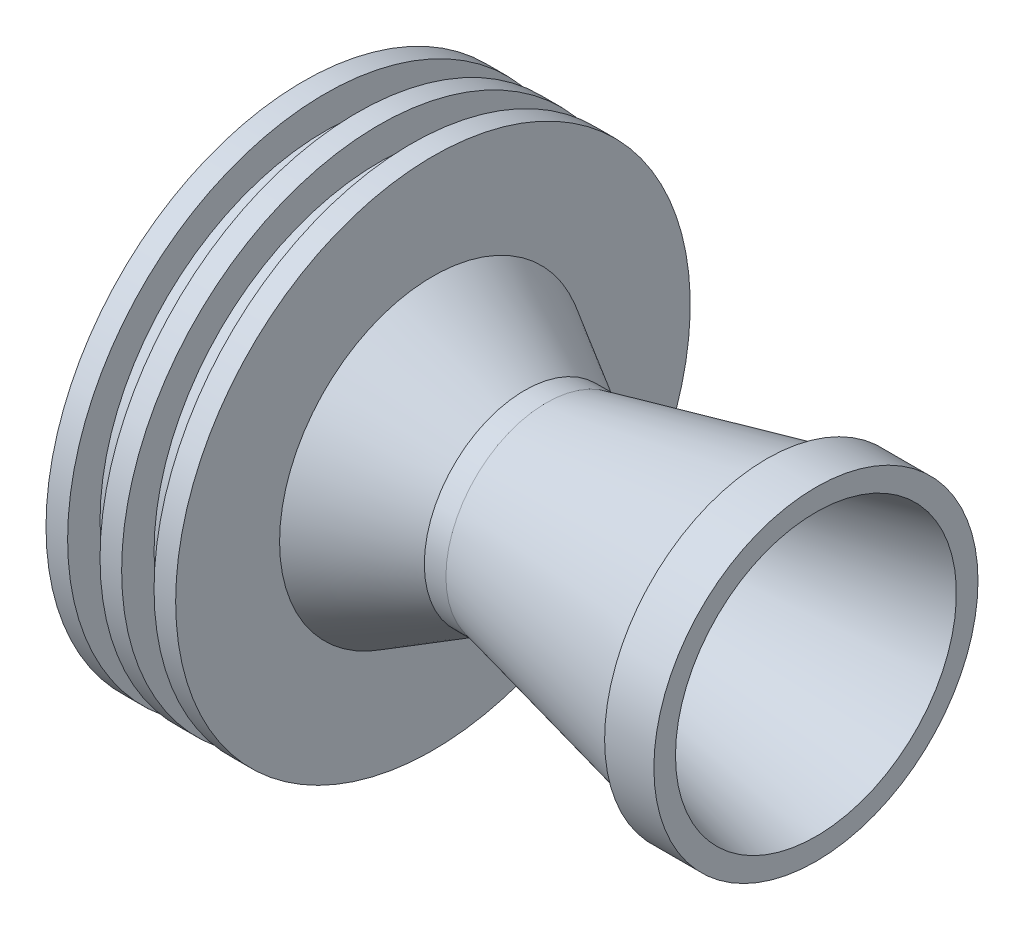
ISO-10303-21;
HEADER;
FILE_DESCRIPTION(('STEP AP214'),'2;1');
FILE_NAME('part.step','',(''),(''),'','','');
FILE_SCHEMA(('AUTOMOTIVE_DESIGN { 1 0 10303 214 1 1 1 1 }'));
ENDSEC;
DATA;
#1=APPLICATION_CONTEXT('core data for automotive mechanical design processes');
#2=APPLICATION_PROTOCOL_DEFINITION('international standard','automotive_design',2000,#1);
#3=PRODUCT_CONTEXT('',#1,'mechanical');
#4=PRODUCT('Part','Part','',(#3));
#5=PRODUCT_RELATED_PRODUCT_CATEGORY('part','',(#4));
#6=PRODUCT_DEFINITION_FORMATION('','',#4);
#7=PRODUCT_DEFINITION_CONTEXT('part definition',#1,'design');
#8=PRODUCT_DEFINITION('design','',#6,#7);
#9=PRODUCT_DEFINITION_SHAPE('','',#8);
#10=(LENGTH_UNIT() NAMED_UNIT(*) SI_UNIT(.MILLI.,.METRE.));
#11=(NAMED_UNIT(*) PLANE_ANGLE_UNIT() SI_UNIT($,.RADIAN.));
#12=(NAMED_UNIT(*) SI_UNIT($,.STERADIAN.) SOLID_ANGLE_UNIT());
#13=UNCERTAINTY_MEASURE_WITH_UNIT(LENGTH_MEASURE(1.E-05),#10,'distance_accuracy_value','');
#14=(GEOMETRIC_REPRESENTATION_CONTEXT(3) GLOBAL_UNCERTAINTY_ASSIGNED_CONTEXT((#13)) GLOBAL_UNIT_ASSIGNED_CONTEXT((#10,
#11,#12)) REPRESENTATION_CONTEXT('',''));
#15=CARTESIAN_POINT('',(0.,0.,0.));
#16=DIRECTION('',(0.,0.,1.));
#17=DIRECTION('',(1.,0.,0.));
#18=AXIS2_PLACEMENT_3D('',#15,#16,#17);
#19=CARTESIAN_POINT('',(0.,20.8125,0.));
#20=DIRECTION('',(1.,0.,0.));
#21=DIRECTION('',(0.,0.,-1.));
#22=AXIS2_PLACEMENT_3D('',#19,#20,#21);
#23=PLANE('',#22);
#24=CARTESIAN_POINT('',(0.,0.,0.));
#25=DIRECTION('',(-1.,0.,0.));
#26=DIRECTION('',(0.,0.,1.));
#27=AXIS2_PLACEMENT_3D('',#24,#25,#26);
#28=CIRCLE('',#27,18.8125);
#29=CARTESIAN_POINT('',(0.,0.,18.8125));
#30=VERTEX_POINT('',#29);
#31=EDGE_CURVE('E10',#30,#30,#28,.T.);
#32=ORIENTED_EDGE('',*,*,#31,.F.);
#33=EDGE_LOOP('',(#32));
#34=FACE_BOUND('',#33,.T.);
#35=CARTESIAN_POINT('',(0.,0.,0.));
#36=DIRECTION('',(-1.,0.,0.));
#37=DIRECTION('',(0.,0.,1.));
#38=AXIS2_PLACEMENT_3D('',#35,#36,#37);
#39=CIRCLE('',#38,23.8125);
#40=CARTESIAN_POINT('',(0.,0.,23.8125));
#41=VERTEX_POINT('',#40);
#42=EDGE_CURVE('E122',#41,#41,#39,.T.);
#43=ORIENTED_EDGE('',*,*,#42,.T.);
#44=EDGE_LOOP('',(#43));
#45=FACE_BOUND('',#44,.T.);
#46=ADVANCED_FACE('F37',(#34,#45),#23,.F.);
#47=CARTESIAN_POINT('',(0.,0.,0.));
#48=DIRECTION('',(-1.,0.,0.));
#49=DIRECTION('',(0.,0.,1.));
#50=AXIS2_PLACEMENT_3D('',#47,#48,#49);
#51=CONICAL_SURFACE('',#50,18.8125,0.523598775598287);
#52=CARTESIAN_POINT('',(20.459850164408,0.,0.));
#53=DIRECTION('',(-1.,0.,0.));
#54=DIRECTION('',(0.,0.,1.));
#55=AXIS2_PLACEMENT_3D('',#52,#53,#54);
#56=CIRCLE('',#55,6.99999999999998);
#57=CARTESIAN_POINT('',(20.459850164408,0.,6.99999999999998));
#58=VERTEX_POINT('',#57);
#59=EDGE_CURVE('E44',#58,#58,#56,.T.);
#60=ORIENTED_EDGE('',*,*,#59,.F.);
#61=EDGE_LOOP('',(#60));
#62=FACE_BOUND('',#61,.T.);
#63=ORIENTED_EDGE('',*,*,#31,.T.);
#64=EDGE_LOOP('',(#63));
#65=FACE_BOUND('',#64,.T.);
#66=ADVANCED_FACE('F233',(#62,#65),#51,.F.);
#67=CARTESIAN_POINT('',(-1000.,0.,0.));
#68=DIRECTION('',(-1.,0.,0.));
#69=DIRECTION('',(0.,0.,1.));
#70=AXIS2_PLACEMENT_3D('',#67,#68,#69);
#71=CYLINDRICAL_SURFACE('',#70,6.99999999999998);
#72=CARTESIAN_POINT('',(21.4598501644079,0.,0.));
#73=DIRECTION('',(-1.,0.,0.));
#74=DIRECTION('',(0.,0.,1.));
#75=AXIS2_PLACEMENT_3D('',#72,#73,#74);
#76=CIRCLE('',#75,6.99999999999998);
#77=CARTESIAN_POINT('',(21.4598501644079,0.,6.99999999999998));
#78=VERTEX_POINT('',#77);
#79=EDGE_CURVE('E50',#78,#78,#76,.T.);
#80=ORIENTED_EDGE('',*,*,#79,.F.);
#81=EDGE_LOOP('',(#80));
#82=FACE_BOUND('',#81,.T.);
#83=ORIENTED_EDGE('',*,*,#59,.T.);
#84=EDGE_LOOP('',(#83));
#85=FACE_BOUND('',#84,.T.);
#86=ADVANCED_FACE('F228',(#82,#85),#71,.F.);
#87=CARTESIAN_POINT('',(21.4598501644079,0.,0.));
#88=DIRECTION('',(1.,0.,0.));
#89=DIRECTION('',(0.,0.,-1.));
#90=AXIS2_PLACEMENT_3D('',#87,#88,#89);
#91=CONICAL_SURFACE('',#90,6.99999999999998,0.226892802759263);
#92=CARTESIAN_POINT('',(47.4487054101129,0.,0.));
#93=DIRECTION('',(-1.,0.,0.));
#94=DIRECTION('',(0.,0.,1.));
#95=AXIS2_PLACEMENT_3D('',#92,#93,#94);
#96=CIRCLE('',#95,13.);
#97=CARTESIAN_POINT('',(47.4487054101129,0.,13.));
#98=VERTEX_POINT('',#97);
#99=EDGE_CURVE('E56',#98,#98,#96,.T.);
#100=ORIENTED_EDGE('',*,*,#99,.F.);
#101=EDGE_LOOP('',(#100));
#102=FACE_BOUND('',#101,.T.);
#103=ORIENTED_EDGE('',*,*,#79,.T.);
#104=EDGE_LOOP('',(#103));
#105=FACE_BOUND('',#104,.T.);
#106=ADVANCED_FACE('F222',(#102,#105),#91,.F.);
#107=CARTESIAN_POINT('',(47.4487054101129,15.,0.));
#108=DIRECTION('',(-1.,0.,0.));
#109=DIRECTION('',(0.,0.,1.));
#110=AXIS2_PLACEMENT_3D('',#107,#108,#109);
#111=PLANE('',#110);
#112=CARTESIAN_POINT('',(47.4487054101129,0.,0.));
#113=DIRECTION('',(-1.,0.,0.));
#114=DIRECTION('',(0.,0.,1.));
#115=AXIS2_PLACEMENT_3D('',#112,#113,#114);
#116=CIRCLE('',#115,15.);
#117=CARTESIAN_POINT('',(47.4487054101129,0.,15.));
#118=VERTEX_POINT('',#117);
#119=EDGE_CURVE('E62',#118,#118,#116,.T.);
#120=ORIENTED_EDGE('',*,*,#119,.F.);
#121=EDGE_LOOP('',(#120));
#122=FACE_BOUND('',#121,.T.);
#123=ORIENTED_EDGE('',*,*,#99,.T.);
#124=EDGE_LOOP('',(#123));
#125=FACE_BOUND('',#124,.T.);
#126=ADVANCED_FACE('F216',(#122,#125),#111,.F.);
#127=CARTESIAN_POINT('',(-1000.,0.,0.));
#128=DIRECTION('',(-1.,0.,0.));
#129=DIRECTION('',(0.,0.,1.));
#130=AXIS2_PLACEMENT_3D('',#127,#128,#129);
#131=CYLINDRICAL_SURFACE('',#130,15.);
#132=CARTESIAN_POINT('',(42.8893583192254,0.,0.));
#133=DIRECTION('',(-1.,0.,0.));
#134=DIRECTION('',(0.,0.,1.));
#135=AXIS2_PLACEMENT_3D('',#132,#133,#134);
#136=CIRCLE('',#135,15.);
#137=CARTESIAN_POINT('',(42.8893583192254,0.,15.));
#138=VERTEX_POINT('',#137);
#139=EDGE_CURVE('E66',#138,#138,#136,.T.);
#140=ORIENTED_EDGE('',*,*,#139,.F.);
#141=EDGE_LOOP('',(#140));
#142=FACE_BOUND('',#141,.T.);
#143=ORIENTED_EDGE('',*,*,#119,.T.);
#144=EDGE_LOOP('',(#143));
#145=FACE_BOUND('',#144,.T.);
#146=ADVANCED_FACE('F210',(#142,#145),#131,.T.);
#147=CARTESIAN_POINT('',(42.8893583192254,14.,0.));
#148=DIRECTION('',(1.,0.,0.));
#149=DIRECTION('',(0.,0.,-1.));
#150=AXIS2_PLACEMENT_3D('',#147,#148,#149);
#151=PLANE('',#150);
#152=CARTESIAN_POINT('',(42.8893583192254,0.,0.));
#153=DIRECTION('',(-1.,0.,0.));
#154=DIRECTION('',(0.,0.,1.));
#155=AXIS2_PLACEMENT_3D('',#152,#153,#154);
#156=CIRCLE('',#155,14.);
#157=CARTESIAN_POINT('',(42.8893583192254,0.,14.));
#158=VERTEX_POINT('',#157);
#159=EDGE_CURVE('E70',#158,#158,#156,.T.);
#160=ORIENTED_EDGE('',*,*,#159,.F.);
#161=EDGE_LOOP('',(#160));
#162=FACE_BOUND('',#161,.T.);
#163=ORIENTED_EDGE('',*,*,#139,.T.);
#164=EDGE_LOOP('',(#163));
#165=FACE_BOUND('',#164,.T.);
#166=ADVANCED_FACE('F204',(#162,#165),#151,.F.);
#167=CARTESIAN_POINT('',(42.8893583192254,0.,0.));
#168=DIRECTION('',(1.,0.,0.));
#169=DIRECTION('',(0.,0.,-1.));
#170=AXIS2_PLACEMENT_3D('',#167,#168,#169);
#171=CONICAL_SURFACE('',#170,14.,0.226892802759263);
#172=CARTESIAN_POINT('',(22.4919264795616,0.,0.));
#173=DIRECTION('',(-1.,0.,0.));
#174=DIRECTION('',(0.,0.,1.));
#175=AXIS2_PLACEMENT_3D('',#172,#173,#174);
#176=CIRCLE('',#175,9.29088180756984);
#177=CARTESIAN_POINT('',(22.4919264795616,0.,9.29088180756984));
#178=VERTEX_POINT('',#177);
#179=EDGE_CURVE('E74',#178,#178,#176,.T.);
#180=ORIENTED_EDGE('',*,*,#179,.F.);
#181=EDGE_LOOP('',(#180));
#182=FACE_BOUND('',#181,.T.);
#183=ORIENTED_EDGE('',*,*,#159,.T.);
#184=EDGE_LOOP('',(#183));
#185=FACE_BOUND('',#184,.T.);
#186=ADVANCED_FACE('F198',(#182,#185),#171,.T.);
#187=CARTESIAN_POINT('',(-1000.,0.,0.));
#188=DIRECTION('',(-1.,0.,0.));
#189=DIRECTION('',(0.,0.,1.));
#190=AXIS2_PLACEMENT_3D('',#187,#188,#189);
#191=CYLINDRICAL_SURFACE('',#190,9.29088180756985);
#192=CARTESIAN_POINT('',(20.4919264795618,0.,0.));
#193=DIRECTION('',(-1.,0.,0.));
#194=DIRECTION('',(0.,0.,1.));
#195=AXIS2_PLACEMENT_3D('',#192,#193,#194);
#196=CIRCLE('',#195,9.29088180756986);
#197=CARTESIAN_POINT('',(20.4919264795618,0.,9.29088180756986));
#198=VERTEX_POINT('',#197);
#199=EDGE_CURVE('E78',#198,#198,#196,.T.);
#200=ORIENTED_EDGE('',*,*,#199,.F.);
#201=EDGE_LOOP('',(#200));
#202=FACE_BOUND('',#201,.T.);
#203=ORIENTED_EDGE('',*,*,#179,.T.);
#204=EDGE_LOOP('',(#203));
#205=FACE_BOUND('',#204,.T.);
#206=ADVANCED_FACE('F192',(#202,#205),#191,.T.);
#207=CARTESIAN_POINT('',(20.4919264795618,0.,0.));
#208=DIRECTION('',(-1.,0.,0.));
#209=DIRECTION('',(0.,0.,1.));
#210=AXIS2_PLACEMENT_3D('',#207,#208,#209);
#211=CONICAL_SURFACE('',#210,9.29088180756986,0.523598775598286);
#212=CARTESIAN_POINT('',(12.,0.,0.));
#213=DIRECTION('',(-1.,0.,0.));
#214=DIRECTION('',(0.,0.,1.));
#215=AXIS2_PLACEMENT_3D('',#212,#213,#214);
#216=CIRCLE('',#215,14.1936978464832);
#217=CARTESIAN_POINT('',(12.,0.,14.1936978464832));
#218=VERTEX_POINT('',#217);
#219=EDGE_CURVE('E82',#218,#218,#216,.T.);
#220=ORIENTED_EDGE('',*,*,#219,.F.);
#221=EDGE_LOOP('',(#220));
#222=FACE_BOUND('',#221,.T.);
#223=ORIENTED_EDGE('',*,*,#199,.T.);
#224=EDGE_LOOP('',(#223));
#225=FACE_BOUND('',#224,.T.);
#226=ADVANCED_FACE('F186',(#222,#225),#211,.T.);
#227=CARTESIAN_POINT('',(12.,23.8125,0.));
#228=DIRECTION('',(-1.,0.,0.));
#229=DIRECTION('',(0.,0.,1.));
#230=AXIS2_PLACEMENT_3D('',#227,#228,#229);
#231=PLANE('',#230);
#232=CARTESIAN_POINT('',(12.,0.,0.));
#233=DIRECTION('',(-1.,0.,0.));
#234=DIRECTION('',(0.,0.,1.));
#235=AXIS2_PLACEMENT_3D('',#232,#233,#234);
#236=CIRCLE('',#235,23.8125);
#237=CARTESIAN_POINT('',(12.,0.,23.8125));
#238=VERTEX_POINT('',#237);
#239=EDGE_CURVE('E86',#238,#238,#236,.T.);
#240=ORIENTED_EDGE('',*,*,#239,.F.);
#241=EDGE_LOOP('',(#240));
#242=FACE_BOUND('',#241,.T.);
#243=ORIENTED_EDGE('',*,*,#219,.T.);
#244=EDGE_LOOP('',(#243));
#245=FACE_BOUND('',#244,.T.);
#246=ADVANCED_FACE('F180',(#242,#245),#231,.F.);
#247=CARTESIAN_POINT('',(-1000.,0.,0.));
#248=DIRECTION('',(-1.,0.,0.));
#249=DIRECTION('',(0.,0.,1.));
#250=AXIS2_PLACEMENT_3D('',#247,#248,#249);
#251=CYLINDRICAL_SURFACE('',#250,23.8125);
#252=CARTESIAN_POINT('',(10.,0.,0.));
#253=DIRECTION('',(-1.,0.,0.));
#254=DIRECTION('',(0.,0.,1.));
#255=AXIS2_PLACEMENT_3D('',#252,#253,#254);
#256=CIRCLE('',#255,23.8125);
#257=CARTESIAN_POINT('',(10.,0.,23.8125));
#258=VERTEX_POINT('',#257);
#259=EDGE_CURVE('E90',#258,#258,#256,.T.);
#260=ORIENTED_EDGE('',*,*,#259,.F.);
#261=EDGE_LOOP('',(#260));
#262=FACE_BOUND('',#261,.T.);
#263=ORIENTED_EDGE('',*,*,#239,.T.);
#264=EDGE_LOOP('',(#263));
#265=FACE_BOUND('',#264,.T.);
#266=ADVANCED_FACE('F174',(#262,#265),#251,.T.);
#267=CARTESIAN_POINT('',(10.,20.8125,0.));
#268=DIRECTION('',(1.,0.,0.));
#269=DIRECTION('',(0.,0.,-1.));
#270=AXIS2_PLACEMENT_3D('',#267,#268,#269);
#271=PLANE('',#270);
#272=CARTESIAN_POINT('',(10.,0.,0.));
#273=DIRECTION('',(-1.,0.,0.));
#274=DIRECTION('',(0.,0.,1.));
#275=AXIS2_PLACEMENT_3D('',#272,#273,#274);
#276=CIRCLE('',#275,20.8125);
#277=CARTESIAN_POINT('',(10.,0.,20.8125));
#278=VERTEX_POINT('',#277);
#279=EDGE_CURVE('E94',#278,#278,#276,.T.);
#280=ORIENTED_EDGE('',*,*,#279,.F.);
#281=EDGE_LOOP('',(#280));
#282=FACE_BOUND('',#281,.T.);
#283=ORIENTED_EDGE('',*,*,#259,.T.);
#284=EDGE_LOOP('',(#283));
#285=FACE_BOUND('',#284,.T.);
#286=ADVANCED_FACE('F168',(#282,#285),#271,.F.);
#287=CARTESIAN_POINT('',(-1000.,0.,0.));
#288=DIRECTION('',(-1.,0.,0.));
#289=DIRECTION('',(0.,0.,1.));
#290=AXIS2_PLACEMENT_3D('',#287,#288,#289);
#291=CYLINDRICAL_SURFACE('',#290,20.8125);
#292=CARTESIAN_POINT('',(6.9999999999999,0.,0.));
#293=DIRECTION('',(-1.,0.,0.));
#294=DIRECTION('',(0.,0.,1.));
#295=AXIS2_PLACEMENT_3D('',#292,#293,#294);
#296=CIRCLE('',#295,20.8125);
#297=CARTESIAN_POINT('',(6.9999999999999,0.,20.8125));
#298=VERTEX_POINT('',#297);
#299=EDGE_CURVE('E98',#298,#298,#296,.T.);
#300=ORIENTED_EDGE('',*,*,#299,.F.);
#301=EDGE_LOOP('',(#300));
#302=FACE_BOUND('',#301,.T.);
#303=ORIENTED_EDGE('',*,*,#279,.T.);
#304=EDGE_LOOP('',(#303));
#305=FACE_BOUND('',#304,.T.);
#306=ADVANCED_FACE('F162',(#302,#305),#291,.T.);
#307=CARTESIAN_POINT('',(7.,23.8125,0.));
#308=DIRECTION('',(-1.,0.,0.));
#309=DIRECTION('',(0.,0.,1.));
#310=AXIS2_PLACEMENT_3D('',#307,#308,#309);
#311=PLANE('',#310);
#312=CARTESIAN_POINT('',(6.9999999999999,0.,0.));
#313=DIRECTION('',(-1.,0.,0.));
#314=DIRECTION('',(0.,0.,1.));
#315=AXIS2_PLACEMENT_3D('',#312,#313,#314);
#316=CIRCLE('',#315,23.8125);
#317=CARTESIAN_POINT('',(6.9999999999999,0.,23.8125));
#318=VERTEX_POINT('',#317);
#319=EDGE_CURVE('E102',#318,#318,#316,.T.);
#320=ORIENTED_EDGE('',*,*,#319,.F.);
#321=EDGE_LOOP('',(#320));
#322=FACE_BOUND('',#321,.T.);
#323=ORIENTED_EDGE('',*,*,#299,.T.);
#324=EDGE_LOOP('',(#323));
#325=FACE_BOUND('',#324,.T.);
#326=ADVANCED_FACE('F156',(#322,#325),#311,.F.);
#327=CARTESIAN_POINT('',(-1000.,0.,0.));
#328=DIRECTION('',(-1.,0.,0.));
#329=DIRECTION('',(0.,0.,1.));
#330=AXIS2_PLACEMENT_3D('',#327,#328,#329);
#331=CYLINDRICAL_SURFACE('',#330,23.8125);
#332=CARTESIAN_POINT('',(4.99999999999989,0.,0.));
#333=DIRECTION('',(-1.,0.,0.));
#334=DIRECTION('',(0.,0.,1.));
#335=AXIS2_PLACEMENT_3D('',#332,#333,#334);
#336=CIRCLE('',#335,23.8125);
#337=CARTESIAN_POINT('',(4.99999999999989,0.,23.8125));
#338=VERTEX_POINT('',#337);
#339=EDGE_CURVE('E106',#338,#338,#336,.T.);
#340=ORIENTED_EDGE('',*,*,#339,.F.);
#341=EDGE_LOOP('',(#340));
#342=FACE_BOUND('',#341,.T.);
#343=ORIENTED_EDGE('',*,*,#319,.T.);
#344=EDGE_LOOP('',(#343));
#345=FACE_BOUND('',#344,.T.);
#346=ADVANCED_FACE('F150',(#342,#345),#331,.T.);
#347=CARTESIAN_POINT('',(5.,20.8125,0.));
#348=DIRECTION('',(1.,0.,0.));
#349=DIRECTION('',(0.,0.,-1.));
#350=AXIS2_PLACEMENT_3D('',#347,#348,#349);
#351=PLANE('',#350);
#352=CARTESIAN_POINT('',(4.99999999999989,0.,0.));
#353=DIRECTION('',(-1.,0.,0.));
#354=DIRECTION('',(0.,0.,1.));
#355=AXIS2_PLACEMENT_3D('',#352,#353,#354);
#356=CIRCLE('',#355,20.8125);
#357=CARTESIAN_POINT('',(4.99999999999989,0.,20.8125));
#358=VERTEX_POINT('',#357);
#359=EDGE_CURVE('E110',#358,#358,#356,.T.);
#360=ORIENTED_EDGE('',*,*,#359,.F.);
#361=EDGE_LOOP('',(#360));
#362=FACE_BOUND('',#361,.T.);
#363=ORIENTED_EDGE('',*,*,#339,.T.);
#364=EDGE_LOOP('',(#363));
#365=FACE_BOUND('',#364,.T.);
#366=ADVANCED_FACE('F144',(#362,#365),#351,.F.);
#367=CARTESIAN_POINT('',(-1000.,0.,0.));
#368=DIRECTION('',(-1.,0.,0.));
#369=DIRECTION('',(0.,0.,1.));
#370=AXIS2_PLACEMENT_3D('',#367,#368,#369);
#371=CYLINDRICAL_SURFACE('',#370,20.8125);
#372=CARTESIAN_POINT('',(2.,0.,0.));
#373=DIRECTION('',(-1.,0.,0.));
#374=DIRECTION('',(0.,0.,1.));
#375=AXIS2_PLACEMENT_3D('',#372,#373,#374);
#376=CIRCLE('',#375,20.8125);
#377=CARTESIAN_POINT('',(2.,0.,20.8125));
#378=VERTEX_POINT('',#377);
#379=EDGE_CURVE('E114',#378,#378,#376,.T.);
#380=ORIENTED_EDGE('',*,*,#379,.F.);
#381=EDGE_LOOP('',(#380));
#382=FACE_BOUND('',#381,.T.);
#383=ORIENTED_EDGE('',*,*,#359,.T.);
#384=EDGE_LOOP('',(#383));
#385=FACE_BOUND('',#384,.T.);
#386=ADVANCED_FACE('F138',(#382,#385),#371,.T.);
#387=CARTESIAN_POINT('',(2.,23.8125,0.));
#388=DIRECTION('',(-1.,0.,0.));
#389=DIRECTION('',(0.,0.,1.));
#390=AXIS2_PLACEMENT_3D('',#387,#388,#389);
#391=PLANE('',#390);
#392=CARTESIAN_POINT('',(2.,0.,0.));
#393=DIRECTION('',(-1.,0.,0.));
#394=DIRECTION('',(0.,0.,1.));
#395=AXIS2_PLACEMENT_3D('',#392,#393,#394);
#396=CIRCLE('',#395,23.8125);
#397=CARTESIAN_POINT('',(2.,0.,23.8125));
#398=VERTEX_POINT('',#397);
#399=EDGE_CURVE('E118',#398,#398,#396,.T.);
#400=ORIENTED_EDGE('',*,*,#399,.F.);
#401=EDGE_LOOP('',(#400));
#402=FACE_BOUND('',#401,.T.);
#403=ORIENTED_EDGE('',*,*,#379,.T.);
#404=EDGE_LOOP('',(#403));
#405=FACE_BOUND('',#404,.T.);
#406=ADVANCED_FACE('F132',(#402,#405),#391,.F.);
#407=CARTESIAN_POINT('',(-1000.,0.,0.));
#408=DIRECTION('',(-1.,0.,0.));
#409=DIRECTION('',(0.,0.,1.));
#410=AXIS2_PLACEMENT_3D('',#407,#408,#409);
#411=CYLINDRICAL_SURFACE('',#410,23.8125);
#412=ORIENTED_EDGE('',*,*,#42,.F.);
#413=EDGE_LOOP('',(#412));
#414=FACE_BOUND('',#413,.T.);
#415=ORIENTED_EDGE('',*,*,#399,.T.);
#416=EDGE_LOOP('',(#415));
#417=FACE_BOUND('',#416,.T.);
#418=ADVANCED_FACE('F129',(#414,#417),#411,.T.);
#419=CLOSED_SHELL('',(#46,#66,#86,#106,#126,#146,#166,#186,#206,#226,#246,#266,#286,#306,#326,
#346,#366,#386,#406,#418));
#420=MANIFOLD_SOLID_BREP('B2',#419);
#421=ADVANCED_BREP_SHAPE_REPRESENTATION('',(#18,#420),#14);
#422=SHAPE_DEFINITION_REPRESENTATION(#9,#421);
ENDSEC;
END-ISO-10303-21;
